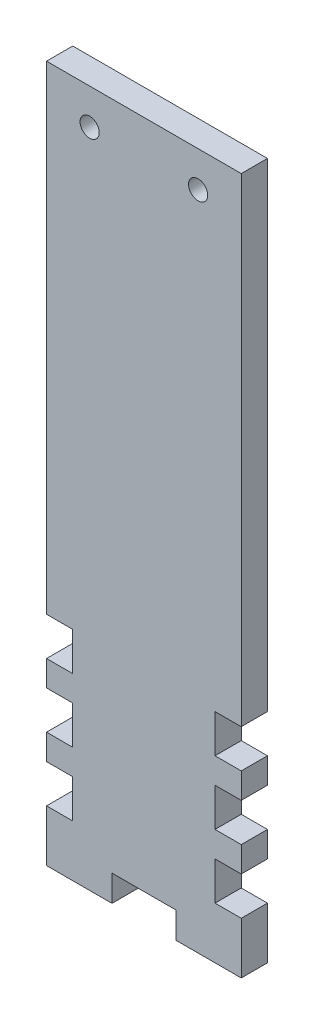
ISO-10303-21;
HEADER;
FILE_DESCRIPTION(('STEP AP214'),'2;1');
FILE_NAME('part.step','',(''),(''),'','','');
FILE_SCHEMA(('AUTOMOTIVE_DESIGN { 1 0 10303 214 1 1 1 1 }'));
ENDSEC;
DATA;
#1=APPLICATION_CONTEXT('core data for automotive mechanical design processes');
#2=APPLICATION_PROTOCOL_DEFINITION('international standard','automotive_design',2000,#1);
#3=PRODUCT_CONTEXT('',#1,'mechanical');
#4=PRODUCT('Part','Part','',(#3));
#5=PRODUCT_RELATED_PRODUCT_CATEGORY('part','',(#4));
#6=PRODUCT_DEFINITION_FORMATION('','',#4);
#7=PRODUCT_DEFINITION_CONTEXT('part definition',#1,'design');
#8=PRODUCT_DEFINITION('design','',#6,#7);
#9=PRODUCT_DEFINITION_SHAPE('','',#8);
#10=(LENGTH_UNIT() NAMED_UNIT(*) SI_UNIT(.MILLI.,.METRE.));
#11=(NAMED_UNIT(*) PLANE_ANGLE_UNIT() SI_UNIT($,.RADIAN.));
#12=(NAMED_UNIT(*) SI_UNIT($,.STERADIAN.) SOLID_ANGLE_UNIT());
#13=UNCERTAINTY_MEASURE_WITH_UNIT(LENGTH_MEASURE(1.E-05),#10,'distance_accuracy_value','');
#14=(GEOMETRIC_REPRESENTATION_CONTEXT(3) GLOBAL_UNCERTAINTY_ASSIGNED_CONTEXT((#13)) GLOBAL_UNIT_ASSIGNED_CONTEXT((#10,
#11,#12)) REPRESENTATION_CONTEXT('',''));
#15=CARTESIAN_POINT('',(0.,0.,0.));
#16=DIRECTION('',(0.,0.,1.));
#17=DIRECTION('',(1.,0.,0.));
#18=AXIS2_PLACEMENT_3D('',#15,#16,#17);
#19=CARTESIAN_POINT('',(-15.26,-123.833512511459,0.889999999999995));
#20=DIRECTION('',(0.,-1.,0.));
#21=DIRECTION('',(0.,0.,-1.));
#22=AXIS2_PLACEMENT_3D('',#19,#20,#21);
#23=PLANE('',#22);
#24=DIRECTION('',(0.,0.,1.));
#25=VECTOR('',#24,1.);
#26=CARTESIAN_POINT('',(4.99999999999999,-123.833512511459,5.));
#27=LINE('',#26,#25);
#28=CARTESIAN_POINT('',(4.99999999999999,-123.833512511459,0.889999999999995));
#29=VERTEX_POINT('',#28);
#30=CARTESIAN_POINT('',(4.99999999999999,-123.833512511459,5.));
#31=VERTEX_POINT('',#30);
#32=EDGE_CURVE('E249',#29,#31,#27,.T.);
#33=ORIENTED_EDGE('',*,*,#32,.F.);
#34=DIRECTION('',(1.,0.,0.));
#35=VECTOR('',#34,1.);
#36=CARTESIAN_POINT('',(-15.26,-123.833512511459,0.889999999999995));
#37=LINE('',#36,#35);
#38=CARTESIAN_POINT('',(15.26,-123.833512511459,0.889999999999995));
#39=VERTEX_POINT('',#38);
#40=EDGE_CURVE('E451',#29,#39,#37,.T.);
#41=ORIENTED_EDGE('',*,*,#40,.T.);
#42=DIRECTION('',(0.,0.,1.));
#43=VECTOR('',#42,1.);
#44=CARTESIAN_POINT('',(15.26,-123.833512511459,0.889999999999995));
#45=LINE('',#44,#43);
#46=CARTESIAN_POINT('',(15.26,-123.833512511459,5.));
#47=VERTEX_POINT('',#46);
#48=EDGE_CURVE('E483',#39,#47,#45,.T.);
#49=ORIENTED_EDGE('',*,*,#48,.T.);
#50=DIRECTION('',(1.,0.,0.));
#51=VECTOR('',#50,1.);
#52=CARTESIAN_POINT('',(-15.26,-123.833512511459,5.));
#53=LINE('',#52,#51);
#54=EDGE_CURVE('E469',#31,#47,#53,.T.);
#55=ORIENTED_EDGE('',*,*,#54,.F.);
#56=EDGE_LOOP('',(#33,#41,#49,#55));
#57=FACE_BOUND('',#56,.T.);
#58=ADVANCED_FACE('F33',(#57),#23,.T.);
#59=CARTESIAN_POINT('',(-15.26,-14.642135623731,0.889999999999995));
#60=DIRECTION('',(-1.,0.,0.));
#61=DIRECTION('',(0.,-1.,0.));
#62=AXIS2_PLACEMENT_3D('',#59,#60,#61);
#63=PLANE('',#62);
#64=DIRECTION('',(0.,-1.,0.));
#65=VECTOR('',#64,1.);
#66=CARTESIAN_POINT('',(-15.26,-14.642135623731,0.889999999999995));
#67=LINE('',#66,#65);
#68=CARTESIAN_POINT('',(-15.26,-95.7235125114591,0.889999999999995));
#69=VERTEX_POINT('',#68);
#70=CARTESIAN_POINT('',(-15.26,-99.7235125114591,0.889999999999995));
#71=VERTEX_POINT('',#70);
#72=EDGE_CURVE('E452',#69,#71,#67,.T.);
#73=ORIENTED_EDGE('',*,*,#72,.T.);
#74=DIRECTION('',(0.,0.,-1.));
#75=VECTOR('',#74,1.);
#76=CARTESIAN_POINT('',(-15.26,-99.7235125114591,5.001));
#77=LINE('',#76,#75);
#78=CARTESIAN_POINT('',(-15.26,-99.7235125114591,5.));
#79=VERTEX_POINT('',#78);
#80=EDGE_CURVE('E299',#79,#71,#77,.T.);
#81=ORIENTED_EDGE('',*,*,#80,.F.);
#82=DIRECTION('',(0.,-1.,0.));
#83=VECTOR('',#82,1.);
#84=CARTESIAN_POINT('',(-15.26,-14.642135623731,5.));
#85=LINE('',#84,#83);
#86=CARTESIAN_POINT('',(-15.26,-95.7235125114591,5.));
#87=VERTEX_POINT('',#86);
#88=EDGE_CURVE('E470',#87,#79,#85,.T.);
#89=ORIENTED_EDGE('',*,*,#88,.F.);
#90=DIRECTION('',(0.,0.,-1.));
#91=VECTOR('',#90,1.);
#92=CARTESIAN_POINT('',(-15.26,-95.7235125114591,5.001));
#93=LINE('',#92,#91);
#94=EDGE_CURVE('E323',#87,#69,#93,.T.);
#95=ORIENTED_EDGE('',*,*,#94,.T.);
#96=EDGE_LOOP('',(#73,#81,#89,#95));
#97=FACE_BOUND('',#96,.T.);
#98=ADVANCED_FACE('F35',(#97),#63,.T.);
#99=CARTESIAN_POINT('',(-15.26,-105.723512511459,5.));
#100=VERTEX_POINT('',#99);
#101=CARTESIAN_POINT('',(-15.26,-109.723512511459,5.));
#102=VERTEX_POINT('',#101);
#103=EDGE_CURVE('E471',#100,#102,#85,.T.);
#104=ORIENTED_EDGE('',*,*,#103,.F.);
#105=DIRECTION('',(0.,0.,-1.));
#106=VECTOR('',#105,1.);
#107=CARTESIAN_POINT('',(-15.26,-105.723512511459,5.001));
#108=LINE('',#107,#106);
#109=CARTESIAN_POINT('',(-15.26,-105.723512511459,0.889999999999995));
#110=VERTEX_POINT('',#109);
#111=EDGE_CURVE('E58',#100,#110,#108,.T.);
#112=ORIENTED_EDGE('',*,*,#111,.T.);
#113=CARTESIAN_POINT('',(-15.26,-109.723512511459,0.889999999999995));
#114=VERTEX_POINT('',#113);
#115=EDGE_CURVE('E453',#110,#114,#67,.T.);
#116=ORIENTED_EDGE('',*,*,#115,.T.);
#117=DIRECTION('',(0.,0.,-1.));
#118=VECTOR('',#117,1.);
#119=CARTESIAN_POINT('',(-15.26,-109.723512511459,5.001));
#120=LINE('',#119,#118);
#121=EDGE_CURVE('E427',#102,#114,#120,.T.);
#122=ORIENTED_EDGE('',*,*,#121,.F.);
#123=EDGE_LOOP('',(#104,#112,#116,#122));
#124=FACE_BOUND('',#123,.T.);
#125=ADVANCED_FACE('F525',(#124),#63,.T.);
#126=CARTESIAN_POINT('',(-15.26,-14.642135623731,0.889999999999995));
#127=VERTEX_POINT('',#126);
#128=CARTESIAN_POINT('',(-15.26,-89.7235125114591,0.889999999999995));
#129=VERTEX_POINT('',#128);
#130=EDGE_CURVE('E448',#127,#129,#67,.T.);
#131=ORIENTED_EDGE('',*,*,#130,.T.);
#132=DIRECTION('',(0.,0.,-1.));
#133=VECTOR('',#132,1.);
#134=CARTESIAN_POINT('',(-15.26,-89.7235125114591,5.001));
#135=LINE('',#134,#133);
#136=CARTESIAN_POINT('',(-15.26,-89.7235125114591,5.));
#137=VERTEX_POINT('',#136);
#138=EDGE_CURVE('E326',#137,#129,#135,.T.);
#139=ORIENTED_EDGE('',*,*,#138,.F.);
#140=CARTESIAN_POINT('',(-15.26,-14.642135623731,5.));
#141=VERTEX_POINT('',#140);
#142=EDGE_CURVE('E466',#141,#137,#85,.T.);
#143=ORIENTED_EDGE('',*,*,#142,.F.);
#144=DIRECTION('',(0.,0.,1.));
#145=VECTOR('',#144,1.);
#146=CARTESIAN_POINT('',(-15.26,-14.642135623731,0.889999999999995));
#147=LINE('',#146,#145);
#148=EDGE_CURVE('E11',#127,#141,#147,.T.);
#149=ORIENTED_EDGE('',*,*,#148,.F.);
#150=EDGE_LOOP('',(#131,#139,#143,#149));
#151=FACE_BOUND('',#150,.T.);
#152=ADVANCED_FACE('F565',(#151),#63,.T.);
#153=CARTESIAN_POINT('',(0.,0.,0.889999999999995));
#154=DIRECTION('',(0.,0.,1.));
#155=DIRECTION('',(1.,0.,0.));
#156=AXIS2_PLACEMENT_3D('',#153,#154,#155);
#157=PLANE('',#156);
#158=ORIENTED_EDGE('',*,*,#40,.F.);
#159=DIRECTION('',(0.,-1.,0.));
#160=VECTOR('',#159,1.);
#161=CARTESIAN_POINT('',(4.99999999999999,-119.723512511459,0.889999999999995));
#162=LINE('',#161,#160);
#163=CARTESIAN_POINT('',(4.99999999999999,-119.723512511459,0.889999999999995));
#164=VERTEX_POINT('',#163);
#165=EDGE_CURVE('E274',#164,#29,#162,.T.);
#166=ORIENTED_EDGE('',*,*,#165,.F.);
#167=DIRECTION('',(1.,0.,0.));
#168=VECTOR('',#167,1.);
#169=CARTESIAN_POINT('',(4.99999999999999,-119.723512511459,0.889999999999995));
#170=LINE('',#169,#168);
#171=CARTESIAN_POINT('',(-5.00000000000001,-119.723512511459,0.889999999999995));
#172=VERTEX_POINT('',#171);
#173=EDGE_CURVE('E253',#172,#164,#170,.T.);
#174=ORIENTED_EDGE('',*,*,#173,.F.);
#175=DIRECTION('',(0.,-1.,0.));
#176=VECTOR('',#175,1.);
#177=CARTESIAN_POINT('',(-5.00000000000001,-119.723512511459,0.889999999999995));
#178=LINE('',#177,#176);
#179=CARTESIAN_POINT('',(-5.00000000000002,-123.833512511459,0.889999999999995));
#180=VERTEX_POINT('',#179);
#181=EDGE_CURVE('E277',#172,#180,#178,.T.);
#182=ORIENTED_EDGE('',*,*,#181,.T.);
#183=CARTESIAN_POINT('',(-15.26,-123.833512511459,0.889999999999995));
#184=VERTEX_POINT('',#183);
#185=EDGE_CURVE('E455',#184,#180,#37,.T.);
#186=ORIENTED_EDGE('',*,*,#185,.F.);
#187=CARTESIAN_POINT('',(-15.26,-115.723512511459,0.889999999999995));
#188=VERTEX_POINT('',#187);
#189=EDGE_CURVE('E454',#188,#184,#67,.T.);
#190=ORIENTED_EDGE('',*,*,#189,.F.);
#191=DIRECTION('',(1.,0.,0.));
#192=VECTOR('',#191,1.);
#193=CARTESIAN_POINT('',(0.,-115.723512511459,0.889999999999995));
#194=LINE('',#193,#192);
#195=CARTESIAN_POINT('',(-11.15,-115.723512511459,0.889999999999995));
#196=VERTEX_POINT('',#195);
#197=EDGE_CURVE('E419',#188,#196,#194,.T.);
#198=ORIENTED_EDGE('',*,*,#197,.T.);
#199=DIRECTION('',(0.,1.,0.));
#200=VECTOR('',#199,1.);
#201=CARTESIAN_POINT('',(-11.1500000000001,0.,0.889999999999995));
#202=LINE('',#201,#200);
#203=CARTESIAN_POINT('',(-11.15,-109.723512511459,0.889999999999995));
#204=VERTEX_POINT('',#203);
#205=EDGE_CURVE('E413',#196,#204,#202,.T.);
#206=ORIENTED_EDGE('',*,*,#205,.T.);
#207=DIRECTION('',(-1.,0.,0.));
#208=VECTOR('',#207,1.);
#209=CARTESIAN_POINT('',(0.,-109.723512511459,0.889999999999995));
#210=LINE('',#209,#208);
#211=EDGE_CURVE('E416',#204,#114,#210,.T.);
#212=ORIENTED_EDGE('',*,*,#211,.T.);
#213=ORIENTED_EDGE('',*,*,#115,.F.);
#214=DIRECTION('',(1.,0.,0.));
#215=VECTOR('',#214,1.);
#216=CARTESIAN_POINT('',(0.,-105.723512511459,0.889999999999995));
#217=LINE('',#216,#215);
#218=CARTESIAN_POINT('',(-11.15,-105.723512511459,0.889999999999995));
#219=VERTEX_POINT('',#218);
#220=EDGE_CURVE('E293',#110,#219,#217,.T.);
#221=ORIENTED_EDGE('',*,*,#220,.T.);
#222=DIRECTION('',(0.,1.,0.));
#223=VECTOR('',#222,1.);
#224=CARTESIAN_POINT('',(-11.1500000000001,0.,0.889999999999995));
#225=LINE('',#224,#223);
#226=CARTESIAN_POINT('',(-11.15,-99.7235125114591,0.889999999999995));
#227=VERTEX_POINT('',#226);
#228=EDGE_CURVE('E287',#219,#227,#225,.T.);
#229=ORIENTED_EDGE('',*,*,#228,.T.);
#230=DIRECTION('',(-1.,0.,0.));
#231=VECTOR('',#230,1.);
#232=CARTESIAN_POINT('',(0.,-99.7235125114591,0.889999999999995));
#233=LINE('',#232,#231);
#234=EDGE_CURVE('E290',#227,#71,#233,.T.);
#235=ORIENTED_EDGE('',*,*,#234,.T.);
#236=ORIENTED_EDGE('',*,*,#72,.F.);
#237=DIRECTION('',(1.,0.,0.));
#238=VECTOR('',#237,1.);
#239=CARTESIAN_POINT('',(0.,-95.7235125114591,0.889999999999995));
#240=LINE('',#239,#238);
#241=CARTESIAN_POINT('',(-11.15,-95.7235125114591,0.889999999999995));
#242=VERTEX_POINT('',#241);
#243=EDGE_CURVE('E318',#69,#242,#240,.T.);
#244=ORIENTED_EDGE('',*,*,#243,.T.);
#245=DIRECTION('',(0.,1.,0.));
#246=VECTOR('',#245,1.);
#247=CARTESIAN_POINT('',(-11.1500000000001,0.,0.889999999999995));
#248=LINE('',#247,#246);
#249=CARTESIAN_POINT('',(-11.15,-89.7235125114591,0.889999999999995));
#250=VERTEX_POINT('',#249);
#251=EDGE_CURVE('E312',#242,#250,#248,.T.);
#252=ORIENTED_EDGE('',*,*,#251,.T.);
#253=DIRECTION('',(-1.,0.,0.));
#254=VECTOR('',#253,1.);
#255=CARTESIAN_POINT('',(0.,-89.7235125114591,0.889999999999995));
#256=LINE('',#255,#254);
#257=EDGE_CURVE('E315',#250,#129,#256,.T.);
#258=ORIENTED_EDGE('',*,*,#257,.T.);
#259=ORIENTED_EDGE('',*,*,#130,.F.);
#260=DIRECTION('',(-1.,0.,0.));
#261=VECTOR('',#260,1.);
#262=CARTESIAN_POINT('',(-15.26,-14.642135623731,0.889999999999995));
#263=LINE('',#262,#261);
#264=CARTESIAN_POINT('',(15.26,-14.642135623731,0.889999999999995));
#265=VERTEX_POINT('',#264);
#266=EDGE_CURVE('E462',#265,#127,#263,.T.);
#267=ORIENTED_EDGE('',*,*,#266,.F.);
#268=DIRECTION('',(0.,1.,0.));
#269=VECTOR('',#268,1.);
#270=CARTESIAN_POINT('',(15.26,-14.642135623731,0.889999999999995));
#271=LINE('',#270,#269);
#272=CARTESIAN_POINT('',(15.26,-89.7235125114591,0.889999999999995));
#273=VERTEX_POINT('',#272);
#274=EDGE_CURVE('E458',#273,#265,#271,.T.);
#275=ORIENTED_EDGE('',*,*,#274,.F.);
#276=DIRECTION('',(-1.,0.,0.));
#277=VECTOR('',#276,1.);
#278=CARTESIAN_POINT('',(0.,-89.7235125114591,0.889999999999995));
#279=LINE('',#278,#277);
#280=CARTESIAN_POINT('',(11.15,-89.7235125114591,0.889999999999995));
#281=VERTEX_POINT('',#280);
#282=EDGE_CURVE('E394',#273,#281,#279,.T.);
#283=ORIENTED_EDGE('',*,*,#282,.T.);
#284=DIRECTION('',(0.,-1.,0.));
#285=VECTOR('',#284,1.);
#286=CARTESIAN_POINT('',(11.15,0.,0.889999999999995));
#287=LINE('',#286,#285);
#288=CARTESIAN_POINT('',(11.15,-95.7235125114591,0.889999999999995));
#289=VERTEX_POINT('',#288);
#290=EDGE_CURVE('E388',#281,#289,#287,.T.);
#291=ORIENTED_EDGE('',*,*,#290,.T.);
#292=DIRECTION('',(1.,0.,0.));
#293=VECTOR('',#292,1.);
#294=CARTESIAN_POINT('',(0.,-95.7235125114591,0.889999999999995));
#295=LINE('',#294,#293);
#296=CARTESIAN_POINT('',(15.26,-95.7235125114591,0.889999999999995));
#297=VERTEX_POINT('',#296);
#298=EDGE_CURVE('E391',#289,#297,#295,.T.);
#299=ORIENTED_EDGE('',*,*,#298,.T.);
#300=CARTESIAN_POINT('',(15.26,-99.7235125114591,0.889999999999995));
#301=VERTEX_POINT('',#300);
#302=EDGE_CURVE('E613',#301,#297,#271,.T.);
#303=ORIENTED_EDGE('',*,*,#302,.F.);
#304=DIRECTION('',(-1.,0.,0.));
#305=VECTOR('',#304,1.);
#306=CARTESIAN_POINT('',(0.,-99.7235125114591,0.889999999999995));
#307=LINE('',#306,#305);
#308=CARTESIAN_POINT('',(11.15,-99.7235125114591,0.889999999999995));
#309=VERTEX_POINT('',#308);
#310=EDGE_CURVE('E370',#301,#309,#307,.T.);
#311=ORIENTED_EDGE('',*,*,#310,.T.);
#312=DIRECTION('',(0.,-1.,0.));
#313=VECTOR('',#312,1.);
#314=CARTESIAN_POINT('',(11.1500000000001,0.,0.889999999999995));
#315=LINE('',#314,#313);
#316=CARTESIAN_POINT('',(11.15,-105.723512511459,0.889999999999995));
#317=VERTEX_POINT('',#316);
#318=EDGE_CURVE('E364',#309,#317,#315,.T.);
#319=ORIENTED_EDGE('',*,*,#318,.T.);
#320=DIRECTION('',(1.,0.,0.));
#321=VECTOR('',#320,1.);
#322=CARTESIAN_POINT('',(0.,-105.723512511459,0.889999999999995));
#323=LINE('',#322,#321);
#324=CARTESIAN_POINT('',(15.26,-105.723512511459,0.889999999999995));
#325=VERTEX_POINT('',#324);
#326=EDGE_CURVE('E367',#317,#325,#323,.T.);
#327=ORIENTED_EDGE('',*,*,#326,.T.);
#328=CARTESIAN_POINT('',(15.26,-109.723512511459,0.889999999999995));
#329=VERTEX_POINT('',#328);
#330=EDGE_CURVE('E463',#329,#325,#271,.T.);
#331=ORIENTED_EDGE('',*,*,#330,.F.);
#332=DIRECTION('',(-1.,0.,0.));
#333=VECTOR('',#332,1.);
#334=CARTESIAN_POINT('',(0.,-109.723512511459,0.889999999999995));
#335=LINE('',#334,#333);
#336=CARTESIAN_POINT('',(11.15,-109.723512511459,0.889999999999995));
#337=VERTEX_POINT('',#336);
#338=EDGE_CURVE('E344',#329,#337,#335,.T.);
#339=ORIENTED_EDGE('',*,*,#338,.T.);
#340=DIRECTION('',(0.,-1.,0.));
#341=VECTOR('',#340,1.);
#342=CARTESIAN_POINT('',(11.1500000000001,0.,0.889999999999995));
#343=LINE('',#342,#341);
#344=CARTESIAN_POINT('',(11.15,-115.723512511459,0.889999999999995));
#345=VERTEX_POINT('',#344);
#346=EDGE_CURVE('E338',#337,#345,#343,.T.);
#347=ORIENTED_EDGE('',*,*,#346,.T.);
#348=DIRECTION('',(1.,0.,0.));
#349=VECTOR('',#348,1.);
#350=CARTESIAN_POINT('',(0.,-115.723512511459,0.889999999999995));
#351=LINE('',#350,#349);
#352=CARTESIAN_POINT('',(15.26,-115.723512511459,0.889999999999995));
#353=VERTEX_POINT('',#352);
#354=EDGE_CURVE('E341',#345,#353,#351,.T.);
#355=ORIENTED_EDGE('',*,*,#354,.T.);
#356=EDGE_CURVE('E459',#39,#353,#271,.T.);
#357=ORIENTED_EDGE('',*,*,#356,.F.);
#358=EDGE_LOOP('',(#158,#166,#174,#182,#186,#190,#198,#206,#212,#213,#221,#229,#235,#236,#244,
#252,#258,#259,#267,#275,#283,#291,#299,#303,#311,#319,#327,#331,#339,#347,#355,#357));
#359=FACE_BOUND('',#358,.T.);
#360=CARTESIAN_POINT('',(-8.5,-20.23,0.889999999999995));
#361=DIRECTION('',(0.,0.,1.));
#362=DIRECTION('',(1.,0.,0.));
#363=AXIS2_PLACEMENT_3D('',#360,#361,#362);
#364=CIRCLE('',#363,1.5);
#365=CARTESIAN_POINT('',(-7.,-20.23,0.889999999999995));
#366=VERTEX_POINT('',#365);
#367=EDGE_CURVE('E436',#366,#366,#364,.T.);
#368=ORIENTED_EDGE('',*,*,#367,.T.);
#369=EDGE_LOOP('',(#368));
#370=FACE_BOUND('',#369,.T.);
#371=CARTESIAN_POINT('',(8.5,-20.23,0.889999999999995));
#372=DIRECTION('',(0.,0.,1.));
#373=DIRECTION('',(1.,0.,0.));
#374=AXIS2_PLACEMENT_3D('',#371,#372,#373);
#375=CIRCLE('',#374,1.5);
#376=CARTESIAN_POINT('',(10.,-20.23,0.889999999999995));
#377=VERTEX_POINT('',#376);
#378=EDGE_CURVE('E442',#377,#377,#375,.T.);
#379=ORIENTED_EDGE('',*,*,#378,.T.);
#380=EDGE_LOOP('',(#379));
#381=FACE_BOUND('',#380,.T.);
#382=ADVANCED_FACE('F515',(#359,#370,#381),#157,.F.);
#383=CARTESIAN_POINT('',(0.,0.,5.));
#384=DIRECTION('',(0.,0.,1.));
#385=DIRECTION('',(1.,0.,0.));
#386=AXIS2_PLACEMENT_3D('',#383,#384,#385);
#387=PLANE('',#386);
#388=DIRECTION('',(0.,-1.,0.));
#389=VECTOR('',#388,1.);
#390=CARTESIAN_POINT('',(4.99999999999999,-119.723512511459,5.));
#391=LINE('',#390,#389);
#392=CARTESIAN_POINT('',(4.99999999999999,-119.723512511459,5.));
#393=VERTEX_POINT('',#392);
#394=EDGE_CURVE('E243',#393,#31,#391,.T.);
#395=ORIENTED_EDGE('',*,*,#394,.T.);
#396=ORIENTED_EDGE('',*,*,#54,.T.);
#397=DIRECTION('',(0.,1.,0.));
#398=VECTOR('',#397,1.);
#399=CARTESIAN_POINT('',(15.26,-14.642135623731,5.));
#400=LINE('',#399,#398);
#401=CARTESIAN_POINT('',(15.26,-115.723512511459,5.));
#402=VERTEX_POINT('',#401);
#403=EDGE_CURVE('E475',#47,#402,#400,.T.);
#404=ORIENTED_EDGE('',*,*,#403,.T.);
#405=DIRECTION('',(1.,0.,0.));
#406=VECTOR('',#405,1.);
#407=CARTESIAN_POINT('',(0.,-115.723512511459,5.));
#408=LINE('',#407,#406);
#409=CARTESIAN_POINT('',(11.15,-115.723512511459,5.));
#410=VERTEX_POINT('',#409);
#411=EDGE_CURVE('E335',#410,#402,#408,.T.);
#412=ORIENTED_EDGE('',*,*,#411,.F.);
#413=DIRECTION('',(0.,-1.,0.));
#414=VECTOR('',#413,1.);
#415=CARTESIAN_POINT('',(11.1500000000001,0.,5.));
#416=LINE('',#415,#414);
#417=CARTESIAN_POINT('',(11.15,-109.723512511459,5.));
#418=VERTEX_POINT('',#417);
#419=EDGE_CURVE('E332',#418,#410,#416,.T.);
#420=ORIENTED_EDGE('',*,*,#419,.F.);
#421=DIRECTION('',(-1.,0.,0.));
#422=VECTOR('',#421,1.);
#423=CARTESIAN_POINT('',(0.,-109.723512511459,5.));
#424=LINE('',#423,#422);
#425=CARTESIAN_POINT('',(15.26,-109.723512511459,5.));
#426=VERTEX_POINT('',#425);
#427=EDGE_CURVE('E310',#426,#418,#424,.T.);
#428=ORIENTED_EDGE('',*,*,#427,.F.);
#429=CARTESIAN_POINT('',(15.26,-105.723512511459,5.));
#430=VERTEX_POINT('',#429);
#431=EDGE_CURVE('E479',#426,#430,#400,.T.);
#432=ORIENTED_EDGE('',*,*,#431,.T.);
#433=DIRECTION('',(1.,0.,0.));
#434=VECTOR('',#433,1.);
#435=CARTESIAN_POINT('',(0.,-105.723512511459,5.));
#436=LINE('',#435,#434);
#437=CARTESIAN_POINT('',(11.15,-105.723512511459,5.));
#438=VERTEX_POINT('',#437);
#439=EDGE_CURVE('E361',#438,#430,#436,.T.);
#440=ORIENTED_EDGE('',*,*,#439,.F.);
#441=DIRECTION('',(0.,-1.,0.));
#442=VECTOR('',#441,1.);
#443=CARTESIAN_POINT('',(11.1500000000001,0.,5.));
#444=LINE('',#443,#442);
#445=CARTESIAN_POINT('',(11.15,-99.7235125114591,5.));
#446=VERTEX_POINT('',#445);
#447=EDGE_CURVE('E358',#446,#438,#444,.T.);
#448=ORIENTED_EDGE('',*,*,#447,.F.);
#449=DIRECTION('',(-1.,0.,0.));
#450=VECTOR('',#449,1.);
#451=CARTESIAN_POINT('',(0.,-99.7235125114591,5.));
#452=LINE('',#451,#450);
#453=CARTESIAN_POINT('',(15.26,-99.7235125114591,5.));
#454=VERTEX_POINT('',#453);
#455=EDGE_CURVE('E336',#454,#446,#452,.T.);
#456=ORIENTED_EDGE('',*,*,#455,.F.);
#457=CARTESIAN_POINT('',(15.26,-95.7235125114591,5.));
#458=VERTEX_POINT('',#457);
#459=EDGE_CURVE('E589',#454,#458,#400,.T.);
#460=ORIENTED_EDGE('',*,*,#459,.T.);
#461=DIRECTION('',(1.,0.,0.));
#462=VECTOR('',#461,1.);
#463=CARTESIAN_POINT('',(0.,-95.7235125114591,5.));
#464=LINE('',#463,#462);
#465=CARTESIAN_POINT('',(11.15,-95.7235125114591,5.));
#466=VERTEX_POINT('',#465);
#467=EDGE_CURVE('E386',#466,#458,#464,.T.);
#468=ORIENTED_EDGE('',*,*,#467,.F.);
#469=DIRECTION('',(0.,-1.,0.));
#470=VECTOR('',#469,1.);
#471=CARTESIAN_POINT('',(11.15,0.,5.));
#472=LINE('',#471,#470);
#473=CARTESIAN_POINT('',(11.15,-89.7235125114591,5.));
#474=VERTEX_POINT('',#473);
#475=EDGE_CURVE('E276',#474,#466,#472,.T.);
#476=ORIENTED_EDGE('',*,*,#475,.F.);
#477=DIRECTION('',(-1.,0.,0.));
#478=VECTOR('',#477,1.);
#479=CARTESIAN_POINT('',(0.,-89.7235125114591,5.));
#480=LINE('',#479,#478);
#481=CARTESIAN_POINT('',(15.26,-89.7235125114591,5.));
#482=VERTEX_POINT('',#481);
#483=EDGE_CURVE('E362',#482,#474,#480,.T.);
#484=ORIENTED_EDGE('',*,*,#483,.F.);
#485=CARTESIAN_POINT('',(15.26,-14.642135623731,5.));
#486=VERTEX_POINT('',#485);
#487=EDGE_CURVE('E474',#482,#486,#400,.T.);
#488=ORIENTED_EDGE('',*,*,#487,.T.);
#489=DIRECTION('',(-1.,0.,0.));
#490=VECTOR('',#489,1.);
#491=CARTESIAN_POINT('',(-15.26,-14.642135623731,5.));
#492=LINE('',#491,#490);
#493=EDGE_CURVE('E478',#486,#141,#492,.T.);
#494=ORIENTED_EDGE('',*,*,#493,.T.);
#495=ORIENTED_EDGE('',*,*,#142,.T.);
#496=DIRECTION('',(-1.,0.,0.));
#497=VECTOR('',#496,1.);
#498=CARTESIAN_POINT('',(0.,-89.7235125114591,5.));
#499=LINE('',#498,#497);
#500=CARTESIAN_POINT('',(-11.15,-89.7235125114591,5.));
#501=VERTEX_POINT('',#500);
#502=EDGE_CURVE('E309',#501,#137,#499,.T.);
#503=ORIENTED_EDGE('',*,*,#502,.F.);
#504=DIRECTION('',(0.,1.,0.));
#505=VECTOR('',#504,1.);
#506=CARTESIAN_POINT('',(-11.1500000000001,0.,5.));
#507=LINE('',#506,#505);
#508=CARTESIAN_POINT('',(-11.15,-95.7235125114591,5.));
#509=VERTEX_POINT('',#508);
#510=EDGE_CURVE('E306',#509,#501,#507,.T.);
#511=ORIENTED_EDGE('',*,*,#510,.F.);
#512=DIRECTION('',(1.,0.,0.));
#513=VECTOR('',#512,1.);
#514=CARTESIAN_POINT('',(0.,-95.7235125114591,5.));
#515=LINE('',#514,#513);
#516=EDGE_CURVE('E285',#87,#509,#515,.T.);
#517=ORIENTED_EDGE('',*,*,#516,.F.);
#518=ORIENTED_EDGE('',*,*,#88,.T.);
#519=DIRECTION('',(-1.,0.,0.));
#520=VECTOR('',#519,1.);
#521=CARTESIAN_POINT('',(0.,-99.7235125114591,5.));
#522=LINE('',#521,#520);
#523=CARTESIAN_POINT('',(-11.15,-99.7235125114591,5.));
#524=VERTEX_POINT('',#523);
#525=EDGE_CURVE('E284',#524,#79,#522,.T.);
#526=ORIENTED_EDGE('',*,*,#525,.F.);
#527=DIRECTION('',(0.,1.,0.));
#528=VECTOR('',#527,1.);
#529=CARTESIAN_POINT('',(-11.1500000000001,0.,5.));
#530=LINE('',#529,#528);
#531=CARTESIAN_POINT('',(-11.15,-105.723512511459,5.));
#532=VERTEX_POINT('',#531);
#533=EDGE_CURVE('E281',#532,#524,#530,.T.);
#534=ORIENTED_EDGE('',*,*,#533,.F.);
#535=DIRECTION('',(1.,0.,0.));
#536=VECTOR('',#535,1.);
#537=CARTESIAN_POINT('',(0.,-105.723512511459,5.));
#538=LINE('',#537,#536);
#539=EDGE_CURVE('E303',#100,#532,#538,.T.);
#540=ORIENTED_EDGE('',*,*,#539,.F.);
#541=ORIENTED_EDGE('',*,*,#103,.T.);
#542=DIRECTION('',(-1.,0.,0.));
#543=VECTOR('',#542,1.);
#544=CARTESIAN_POINT('',(0.,-109.723512511459,5.));
#545=LINE('',#544,#543);
#546=CARTESIAN_POINT('',(-11.15,-109.723512511459,5.));
#547=VERTEX_POINT('',#546);
#548=EDGE_CURVE('E410',#547,#102,#545,.T.);
#549=ORIENTED_EDGE('',*,*,#548,.F.);
#550=DIRECTION('',(0.,1.,0.));
#551=VECTOR('',#550,1.);
#552=CARTESIAN_POINT('',(-11.1500000000001,0.,5.));
#553=LINE('',#552,#551);
#554=CARTESIAN_POINT('',(-11.15,-115.723512511459,5.));
#555=VERTEX_POINT('',#554);
#556=EDGE_CURVE('E305',#555,#547,#553,.T.);
#557=ORIENTED_EDGE('',*,*,#556,.F.);
#558=DIRECTION('',(1.,0.,0.));
#559=VECTOR('',#558,1.);
#560=CARTESIAN_POINT('',(0.,-115.723512511459,5.));
#561=LINE('',#560,#559);
#562=CARTESIAN_POINT('',(-15.26,-115.723512511459,5.));
#563=VERTEX_POINT('',#562);
#564=EDGE_CURVE('E432',#563,#555,#561,.T.);
#565=ORIENTED_EDGE('',*,*,#564,.F.);
#566=CARTESIAN_POINT('',(-15.26,-123.833512511459,5.));
#567=VERTEX_POINT('',#566);
#568=EDGE_CURVE('E445',#563,#567,#85,.T.);
#569=ORIENTED_EDGE('',*,*,#568,.T.);
#570=CARTESIAN_POINT('',(-5.00000000000002,-123.833512511459,5.));
#571=VERTEX_POINT('',#570);
#572=EDGE_CURVE('E472',#567,#571,#53,.T.);
#573=ORIENTED_EDGE('',*,*,#572,.T.);
#574=DIRECTION('',(0.,-1.,0.));
#575=VECTOR('',#574,1.);
#576=CARTESIAN_POINT('',(-5.00000000000001,-119.723512511459,5.));
#577=LINE('',#576,#575);
#578=CARTESIAN_POINT('',(-5.00000000000001,-119.723512511459,5.));
#579=VERTEX_POINT('',#578);
#580=EDGE_CURVE('E50',#579,#571,#577,.T.);
#581=ORIENTED_EDGE('',*,*,#580,.F.);
#582=DIRECTION('',(-1.,0.,0.));
#583=VECTOR('',#582,1.);
#584=CARTESIAN_POINT('',(4.99999999999999,-119.723512511459,5.));
#585=LINE('',#584,#583);
#586=EDGE_CURVE('E259',#393,#579,#585,.T.);
#587=ORIENTED_EDGE('',*,*,#586,.F.);
#588=EDGE_LOOP('',(#395,#396,#404,#412,#420,#428,#432,#440,#448,#456,#460,#468,#476,#484,#488,
#494,#495,#503,#511,#517,#518,#526,#534,#540,#541,#549,#557,#565,#569,#573,#581,#587));
#589=FACE_BOUND('',#588,.T.);
#590=CARTESIAN_POINT('',(-8.5,-20.23,5.));
#591=DIRECTION('',(0.,0.,1.));
#592=DIRECTION('',(1.,0.,0.));
#593=AXIS2_PLACEMENT_3D('',#590,#591,#592);
#594=CIRCLE('',#593,1.5);
#595=CARTESIAN_POINT('',(-7.,-20.23,5.));
#596=VERTEX_POINT('',#595);
#597=EDGE_CURVE('E435',#596,#596,#594,.T.);
#598=ORIENTED_EDGE('',*,*,#597,.F.);
#599=EDGE_LOOP('',(#598));
#600=FACE_BOUND('',#599,.T.);
#601=CARTESIAN_POINT('',(8.5,-20.23,5.));
#602=DIRECTION('',(0.,0.,1.));
#603=DIRECTION('',(1.,0.,0.));
#604=AXIS2_PLACEMENT_3D('',#601,#602,#603);
#605=CIRCLE('',#604,1.5);
#606=CARTESIAN_POINT('',(10.,-20.23,5.));
#607=VERTEX_POINT('',#606);
#608=EDGE_CURVE('E439',#607,#607,#605,.T.);
#609=ORIENTED_EDGE('',*,*,#608,.F.);
#610=EDGE_LOOP('',(#609));
#611=FACE_BOUND('',#610,.T.);
#612=ADVANCED_FACE('F264',(#589,#600,#611),#387,.T.);
#613=CARTESIAN_POINT('',(15.26,-14.642135623731,0.889999999999995));
#614=DIRECTION('',(1.,0.,0.));
#615=DIRECTION('',(0.,1.,0.));
#616=AXIS2_PLACEMENT_3D('',#613,#614,#615);
#617=PLANE('',#616);
#618=ORIENTED_EDGE('',*,*,#356,.T.);
#619=DIRECTION('',(0.,0.,-1.));
#620=VECTOR('',#619,1.);
#621=CARTESIAN_POINT('',(15.26,-115.723512511459,5.001));
#622=LINE('',#621,#620);
#623=EDGE_CURVE('E352',#402,#353,#622,.T.);
#624=ORIENTED_EDGE('',*,*,#623,.F.);
#625=ORIENTED_EDGE('',*,*,#403,.F.);
#626=ORIENTED_EDGE('',*,*,#48,.F.);
#627=EDGE_LOOP('',(#618,#624,#625,#626));
#628=FACE_BOUND('',#627,.T.);
#629=ADVANCED_FACE('F569',(#628),#617,.T.);
#630=ORIENTED_EDGE('',*,*,#431,.F.);
#631=DIRECTION('',(0.,0.,-1.));
#632=VECTOR('',#631,1.);
#633=CARTESIAN_POINT('',(15.26,-109.723512511459,5.001));
#634=LINE('',#633,#632);
#635=EDGE_CURVE('E349',#426,#329,#634,.T.);
#636=ORIENTED_EDGE('',*,*,#635,.T.);
#637=ORIENTED_EDGE('',*,*,#330,.T.);
#638=DIRECTION('',(0.,0.,-1.));
#639=VECTOR('',#638,1.);
#640=CARTESIAN_POINT('',(15.26,-105.723512511459,5.001));
#641=LINE('',#640,#639);
#642=EDGE_CURVE('E378',#430,#325,#641,.T.);
#643=ORIENTED_EDGE('',*,*,#642,.F.);
#644=EDGE_LOOP('',(#630,#636,#637,#643));
#645=FACE_BOUND('',#644,.T.);
#646=ADVANCED_FACE('F571',(#645),#617,.T.);
#647=ORIENTED_EDGE('',*,*,#459,.F.);
#648=DIRECTION('',(0.,0.,-1.));
#649=VECTOR('',#648,1.);
#650=CARTESIAN_POINT('',(15.26,-99.7235125114591,5.001));
#651=LINE('',#650,#649);
#652=EDGE_CURVE('E375',#454,#301,#651,.T.);
#653=ORIENTED_EDGE('',*,*,#652,.T.);
#654=ORIENTED_EDGE('',*,*,#302,.T.);
#655=DIRECTION('',(0.,0.,-1.));
#656=VECTOR('',#655,1.);
#657=CARTESIAN_POINT('',(15.26,-95.7235125114591,5.001));
#658=LINE('',#657,#656);
#659=EDGE_CURVE('E402',#458,#297,#658,.T.);
#660=ORIENTED_EDGE('',*,*,#659,.F.);
#661=EDGE_LOOP('',(#647,#653,#654,#660));
#662=FACE_BOUND('',#661,.T.);
#663=ADVANCED_FACE('F577',(#662),#617,.T.);
#664=ORIENTED_EDGE('',*,*,#487,.F.);
#665=DIRECTION('',(0.,0.,-1.));
#666=VECTOR('',#665,1.);
#667=CARTESIAN_POINT('',(15.26,-89.7235125114591,5.001));
#668=LINE('',#667,#666);
#669=EDGE_CURVE('E399',#482,#273,#668,.T.);
#670=ORIENTED_EDGE('',*,*,#669,.T.);
#671=ORIENTED_EDGE('',*,*,#274,.T.);
#672=DIRECTION('',(0.,0.,1.));
#673=VECTOR('',#672,1.);
#674=CARTESIAN_POINT('',(15.26,-14.642135623731,0.889999999999995));
#675=LINE('',#674,#673);
#676=EDGE_CURVE('E42',#265,#486,#675,.T.);
#677=ORIENTED_EDGE('',*,*,#676,.T.);
#678=EDGE_LOOP('',(#664,#670,#671,#677));
#679=FACE_BOUND('',#678,.T.);
#680=ADVANCED_FACE('F564',(#679),#617,.T.);
#681=ORIENTED_EDGE('',*,*,#568,.F.);
#682=DIRECTION('',(0.,0.,-1.));
#683=VECTOR('',#682,1.);
#684=CARTESIAN_POINT('',(-15.26,-115.723512511459,5.001));
#685=LINE('',#684,#683);
#686=EDGE_CURVE('E424',#563,#188,#685,.T.);
#687=ORIENTED_EDGE('',*,*,#686,.T.);
#688=ORIENTED_EDGE('',*,*,#189,.T.);
#689=DIRECTION('',(0.,0.,1.));
#690=VECTOR('',#689,1.);
#691=CARTESIAN_POINT('',(-15.26,-123.833512511459,0.889999999999995));
#692=LINE('',#691,#690);
#693=EDGE_CURVE('E37',#184,#567,#692,.T.);
#694=ORIENTED_EDGE('',*,*,#693,.T.);
#695=EDGE_LOOP('',(#681,#687,#688,#694));
#696=FACE_BOUND('',#695,.T.);
#697=ADVANCED_FACE('F493',(#696),#63,.T.);
#698=CARTESIAN_POINT('',(-15.26,-14.642135623731,0.889999999999995));
#699=DIRECTION('',(0.,1.,0.));
#700=DIRECTION('',(0.,0.,1.));
#701=AXIS2_PLACEMENT_3D('',#698,#699,#700);
#702=PLANE('',#701);
#703=ORIENTED_EDGE('',*,*,#493,.F.);
#704=ORIENTED_EDGE('',*,*,#676,.F.);
#705=ORIENTED_EDGE('',*,*,#266,.T.);
#706=ORIENTED_EDGE('',*,*,#148,.T.);
#707=EDGE_LOOP('',(#703,#704,#705,#706));
#708=FACE_BOUND('',#707,.T.);
#709=ADVANCED_FACE('F551',(#708),#702,.T.);
#710=DIRECTION('',(0.,0.,-1.));
#711=VECTOR('',#710,1.);
#712=CARTESIAN_POINT('',(-5.00000000000002,-123.833512511459,5.));
#713=LINE('',#712,#711);
#714=EDGE_CURVE('E262',#571,#180,#713,.T.);
#715=ORIENTED_EDGE('',*,*,#714,.F.);
#716=ORIENTED_EDGE('',*,*,#572,.F.);
#717=ORIENTED_EDGE('',*,*,#693,.F.);
#718=ORIENTED_EDGE('',*,*,#185,.T.);
#719=EDGE_LOOP('',(#715,#716,#717,#718));
#720=FACE_BOUND('',#719,.T.);
#721=ADVANCED_FACE('F497',(#720),#23,.T.);
#722=CARTESIAN_POINT('',(8.5,-20.23,0.889999999999995));
#723=DIRECTION('',(0.,0.,1.));
#724=DIRECTION('',(1.,0.,0.));
#725=AXIS2_PLACEMENT_3D('',#722,#723,#724);
#726=CYLINDRICAL_SURFACE('',#725,1.5);
#727=ORIENTED_EDGE('',*,*,#378,.F.);
#728=EDGE_LOOP('',(#727));
#729=FACE_BOUND('',#728,.T.);
#730=ORIENTED_EDGE('',*,*,#608,.T.);
#731=EDGE_LOOP('',(#730));
#732=FACE_BOUND('',#731,.T.);
#733=ADVANCED_FACE('F550',(#729,#732),#726,.F.);
#734=CARTESIAN_POINT('',(-8.5,-20.23,0.889999999999995));
#735=DIRECTION('',(0.,0.,1.));
#736=DIRECTION('',(1.,0.,0.));
#737=AXIS2_PLACEMENT_3D('',#734,#735,#736);
#738=CYLINDRICAL_SURFACE('',#737,1.5);
#739=ORIENTED_EDGE('',*,*,#367,.F.);
#740=EDGE_LOOP('',(#739));
#741=FACE_BOUND('',#740,.T.);
#742=ORIENTED_EDGE('',*,*,#597,.T.);
#743=EDGE_LOOP('',(#742));
#744=FACE_BOUND('',#743,.T.);
#745=ADVANCED_FACE('F556',(#741,#744),#738,.F.);
#746=CARTESIAN_POINT('',(-11.1500000000001,0.,5.001));
#747=DIRECTION('',(-1.,0.,0.));
#748=DIRECTION('',(0.,-1.,0.));
#749=AXIS2_PLACEMENT_3D('',#746,#747,#748);
#750=PLANE('',#749);
#751=ORIENTED_EDGE('',*,*,#556,.T.);
#752=DIRECTION('',(0.,0.,-1.));
#753=VECTOR('',#752,1.);
#754=CARTESIAN_POINT('',(-11.15,-109.723512511459,5.001));
#755=LINE('',#754,#753);
#756=EDGE_CURVE('E430',#547,#204,#755,.T.);
#757=ORIENTED_EDGE('',*,*,#756,.T.);
#758=ORIENTED_EDGE('',*,*,#205,.F.);
#759=DIRECTION('',(0.,0.,-1.));
#760=VECTOR('',#759,1.);
#761=CARTESIAN_POINT('',(-11.15,-115.723512511459,5.001));
#762=LINE('',#761,#760);
#763=EDGE_CURVE('E422',#555,#196,#762,.T.);
#764=ORIENTED_EDGE('',*,*,#763,.F.);
#765=EDGE_LOOP('',(#751,#757,#758,#764));
#766=FACE_BOUND('',#765,.T.);
#767=ADVANCED_FACE('F531',(#766),#750,.T.);
#768=CARTESIAN_POINT('',(0.,-109.723512511459,5.001));
#769=DIRECTION('',(0.,-1.,0.));
#770=DIRECTION('',(0.,0.,-1.));
#771=AXIS2_PLACEMENT_3D('',#768,#769,#770);
#772=PLANE('',#771);
#773=ORIENTED_EDGE('',*,*,#548,.T.);
#774=ORIENTED_EDGE('',*,*,#121,.T.);
#775=ORIENTED_EDGE('',*,*,#211,.F.);
#776=ORIENTED_EDGE('',*,*,#756,.F.);
#777=EDGE_LOOP('',(#773,#774,#775,#776));
#778=FACE_BOUND('',#777,.T.);
#779=ADVANCED_FACE('F528',(#778),#772,.T.);
#780=CARTESIAN_POINT('',(0.,-115.723512511459,5.001));
#781=DIRECTION('',(0.,1.,0.));
#782=DIRECTION('',(0.,0.,1.));
#783=AXIS2_PLACEMENT_3D('',#780,#781,#782);
#784=PLANE('',#783);
#785=ORIENTED_EDGE('',*,*,#564,.T.);
#786=ORIENTED_EDGE('',*,*,#763,.T.);
#787=ORIENTED_EDGE('',*,*,#197,.F.);
#788=ORIENTED_EDGE('',*,*,#686,.F.);
#789=EDGE_LOOP('',(#785,#786,#787,#788));
#790=FACE_BOUND('',#789,.T.);
#791=ADVANCED_FACE('F533',(#790),#784,.T.);
#792=CARTESIAN_POINT('',(11.15,0.,5.001));
#793=DIRECTION('',(1.,0.,0.));
#794=DIRECTION('',(0.,0.,-1.));
#795=AXIS2_PLACEMENT_3D('',#792,#793,#794);
#796=PLANE('',#795);
#797=ORIENTED_EDGE('',*,*,#475,.T.);
#798=DIRECTION('',(0.,0.,-1.));
#799=VECTOR('',#798,1.);
#800=CARTESIAN_POINT('',(11.15,-95.7235125114591,5.001));
#801=LINE('',#800,#799);
#802=EDGE_CURVE('E404',#466,#289,#801,.T.);
#803=ORIENTED_EDGE('',*,*,#802,.T.);
#804=ORIENTED_EDGE('',*,*,#290,.F.);
#805=DIRECTION('',(0.,0.,-1.));
#806=VECTOR('',#805,1.);
#807=CARTESIAN_POINT('',(11.15,-89.7235125114591,5.001));
#808=LINE('',#807,#806);
#809=EDGE_CURVE('E397',#474,#281,#808,.T.);
#810=ORIENTED_EDGE('',*,*,#809,.F.);
#811=EDGE_LOOP('',(#797,#803,#804,#810));
#812=FACE_BOUND('',#811,.T.);
#813=ADVANCED_FACE('F619',(#812),#796,.T.);
#814=CARTESIAN_POINT('',(0.,-95.7235125114591,5.001));
#815=DIRECTION('',(0.,1.,0.));
#816=DIRECTION('',(0.,0.,1.));
#817=AXIS2_PLACEMENT_3D('',#814,#815,#816);
#818=PLANE('',#817);
#819=ORIENTED_EDGE('',*,*,#467,.T.);
#820=ORIENTED_EDGE('',*,*,#659,.T.);
#821=ORIENTED_EDGE('',*,*,#298,.F.);
#822=ORIENTED_EDGE('',*,*,#802,.F.);
#823=EDGE_LOOP('',(#819,#820,#821,#822));
#824=FACE_BOUND('',#823,.T.);
#825=ADVANCED_FACE('F616',(#824),#818,.T.);
#826=CARTESIAN_POINT('',(0.,-89.7235125114591,5.001));
#827=DIRECTION('',(0.,-1.,0.));
#828=DIRECTION('',(0.,0.,-1.));
#829=AXIS2_PLACEMENT_3D('',#826,#827,#828);
#830=PLANE('',#829);
#831=ORIENTED_EDGE('',*,*,#483,.T.);
#832=ORIENTED_EDGE('',*,*,#809,.T.);
#833=ORIENTED_EDGE('',*,*,#282,.F.);
#834=ORIENTED_EDGE('',*,*,#669,.F.);
#835=EDGE_LOOP('',(#831,#832,#833,#834));
#836=FACE_BOUND('',#835,.T.);
#837=ADVANCED_FACE('F622',(#836),#830,.T.);
#838=CARTESIAN_POINT('',(11.1500000000001,0.,5.001));
#839=DIRECTION('',(1.,0.,0.));
#840=DIRECTION('',(0.,1.,0.));
#841=AXIS2_PLACEMENT_3D('',#838,#839,#840);
#842=PLANE('',#841);
#843=ORIENTED_EDGE('',*,*,#447,.T.);
#844=DIRECTION('',(0.,0.,-1.));
#845=VECTOR('',#844,1.);
#846=CARTESIAN_POINT('',(11.15,-105.723512511459,5.001));
#847=LINE('',#846,#845);
#848=EDGE_CURVE('E380',#438,#317,#847,.T.);
#849=ORIENTED_EDGE('',*,*,#848,.T.);
#850=ORIENTED_EDGE('',*,*,#318,.F.);
#851=DIRECTION('',(0.,0.,-1.));
#852=VECTOR('',#851,1.);
#853=CARTESIAN_POINT('',(11.15,-99.7235125114591,5.001));
#854=LINE('',#853,#852);
#855=EDGE_CURVE('E373',#446,#309,#854,.T.);
#856=ORIENTED_EDGE('',*,*,#855,.F.);
#857=EDGE_LOOP('',(#843,#849,#850,#856));
#858=FACE_BOUND('',#857,.T.);
#859=ADVANCED_FACE('F609',(#858),#842,.T.);
#860=CARTESIAN_POINT('',(0.,-105.723512511459,5.001));
#861=DIRECTION('',(0.,1.,0.));
#862=DIRECTION('',(0.,0.,1.));
#863=AXIS2_PLACEMENT_3D('',#860,#861,#862);
#864=PLANE('',#863);
#865=ORIENTED_EDGE('',*,*,#439,.T.);
#866=ORIENTED_EDGE('',*,*,#642,.T.);
#867=ORIENTED_EDGE('',*,*,#326,.F.);
#868=ORIENTED_EDGE('',*,*,#848,.F.);
#869=EDGE_LOOP('',(#865,#866,#867,#868));
#870=FACE_BOUND('',#869,.T.);
#871=ADVANCED_FACE('F605',(#870),#864,.T.);
#872=CARTESIAN_POINT('',(0.,-99.7235125114591,5.001));
#873=DIRECTION('',(0.,-1.,0.));
#874=DIRECTION('',(0.,0.,-1.));
#875=AXIS2_PLACEMENT_3D('',#872,#873,#874);
#876=PLANE('',#875);
#877=ORIENTED_EDGE('',*,*,#455,.T.);
#878=ORIENTED_EDGE('',*,*,#855,.T.);
#879=ORIENTED_EDGE('',*,*,#310,.F.);
#880=ORIENTED_EDGE('',*,*,#652,.F.);
#881=EDGE_LOOP('',(#877,#878,#879,#880));
#882=FACE_BOUND('',#881,.T.);
#883=ADVANCED_FACE('F687',(#882),#876,.T.);
#884=CARTESIAN_POINT('',(11.1500000000001,0.,5.001));
#885=DIRECTION('',(1.,0.,0.));
#886=DIRECTION('',(0.,1.,0.));
#887=AXIS2_PLACEMENT_3D('',#884,#885,#886);
#888=PLANE('',#887);
#889=ORIENTED_EDGE('',*,*,#419,.T.);
#890=DIRECTION('',(0.,0.,-1.));
#891=VECTOR('',#890,1.);
#892=CARTESIAN_POINT('',(11.15,-115.723512511459,5.001));
#893=LINE('',#892,#891);
#894=EDGE_CURVE('E354',#410,#345,#893,.T.);
#895=ORIENTED_EDGE('',*,*,#894,.T.);
#896=ORIENTED_EDGE('',*,*,#346,.F.);
#897=DIRECTION('',(0.,0.,-1.));
#898=VECTOR('',#897,1.);
#899=CARTESIAN_POINT('',(11.15,-109.723512511459,5.001));
#900=LINE('',#899,#898);
#901=EDGE_CURVE('E347',#418,#337,#900,.T.);
#902=ORIENTED_EDGE('',*,*,#901,.F.);
#903=EDGE_LOOP('',(#889,#895,#896,#902));
#904=FACE_BOUND('',#903,.T.);
#905=ADVANCED_FACE('F683',(#904),#888,.T.);
#906=CARTESIAN_POINT('',(0.,-115.723512511459,5.001));
#907=DIRECTION('',(0.,1.,0.));
#908=DIRECTION('',(0.,0.,1.));
#909=AXIS2_PLACEMENT_3D('',#906,#907,#908);
#910=PLANE('',#909);
#911=ORIENTED_EDGE('',*,*,#411,.T.);
#912=ORIENTED_EDGE('',*,*,#623,.T.);
#913=ORIENTED_EDGE('',*,*,#354,.F.);
#914=ORIENTED_EDGE('',*,*,#894,.F.);
#915=EDGE_LOOP('',(#911,#912,#913,#914));
#916=FACE_BOUND('',#915,.T.);
#917=ADVANCED_FACE('F679',(#916),#910,.T.);
#918=CARTESIAN_POINT('',(0.,-109.723512511459,5.001));
#919=DIRECTION('',(0.,-1.,0.));
#920=DIRECTION('',(0.,0.,-1.));
#921=AXIS2_PLACEMENT_3D('',#918,#919,#920);
#922=PLANE('',#921);
#923=ORIENTED_EDGE('',*,*,#427,.T.);
#924=ORIENTED_EDGE('',*,*,#901,.T.);
#925=ORIENTED_EDGE('',*,*,#338,.F.);
#926=ORIENTED_EDGE('',*,*,#635,.F.);
#927=EDGE_LOOP('',(#923,#924,#925,#926));
#928=FACE_BOUND('',#927,.T.);
#929=ADVANCED_FACE('F676',(#928),#922,.T.);
#930=CARTESIAN_POINT('',(-11.1500000000001,0.,5.001));
#931=DIRECTION('',(-1.,0.,0.));
#932=DIRECTION('',(0.,-1.,0.));
#933=AXIS2_PLACEMENT_3D('',#930,#931,#932);
#934=PLANE('',#933);
#935=ORIENTED_EDGE('',*,*,#510,.T.);
#936=DIRECTION('',(0.,0.,-1.));
#937=VECTOR('',#936,1.);
#938=CARTESIAN_POINT('',(-11.15,-89.7235125114591,5.001));
#939=LINE('',#938,#937);
#940=EDGE_CURVE('E328',#501,#250,#939,.T.);
#941=ORIENTED_EDGE('',*,*,#940,.T.);
#942=ORIENTED_EDGE('',*,*,#251,.F.);
#943=DIRECTION('',(0.,0.,-1.));
#944=VECTOR('',#943,1.);
#945=CARTESIAN_POINT('',(-11.15,-95.7235125114591,5.001));
#946=LINE('',#945,#944);
#947=EDGE_CURVE('E321',#509,#242,#946,.T.);
#948=ORIENTED_EDGE('',*,*,#947,.F.);
#949=EDGE_LOOP('',(#935,#941,#942,#948));
#950=FACE_BOUND('',#949,.T.);
#951=ADVANCED_FACE('F661',(#950),#934,.T.);
#952=CARTESIAN_POINT('',(0.,-89.7235125114591,5.001));
#953=DIRECTION('',(0.,-1.,0.));
#954=DIRECTION('',(0.,0.,-1.));
#955=AXIS2_PLACEMENT_3D('',#952,#953,#954);
#956=PLANE('',#955);
#957=ORIENTED_EDGE('',*,*,#502,.T.);
#958=ORIENTED_EDGE('',*,*,#138,.T.);
#959=ORIENTED_EDGE('',*,*,#257,.F.);
#960=ORIENTED_EDGE('',*,*,#940,.F.);
#961=EDGE_LOOP('',(#957,#958,#959,#960));
#962=FACE_BOUND('',#961,.T.);
#963=ADVANCED_FACE('F658',(#962),#956,.T.);
#964=CARTESIAN_POINT('',(0.,-95.7235125114591,5.001));
#965=DIRECTION('',(0.,1.,0.));
#966=DIRECTION('',(0.,0.,1.));
#967=AXIS2_PLACEMENT_3D('',#964,#965,#966);
#968=PLANE('',#967);
#969=ORIENTED_EDGE('',*,*,#516,.T.);
#970=ORIENTED_EDGE('',*,*,#947,.T.);
#971=ORIENTED_EDGE('',*,*,#243,.F.);
#972=ORIENTED_EDGE('',*,*,#94,.F.);
#973=EDGE_LOOP('',(#969,#970,#971,#972));
#974=FACE_BOUND('',#973,.T.);
#975=ADVANCED_FACE('F663',(#974),#968,.T.);
#976=CARTESIAN_POINT('',(-11.1500000000001,0.,5.001));
#977=DIRECTION('',(-1.,0.,0.));
#978=DIRECTION('',(0.,-1.,0.));
#979=AXIS2_PLACEMENT_3D('',#976,#977,#978);
#980=PLANE('',#979);
#981=ORIENTED_EDGE('',*,*,#533,.T.);
#982=DIRECTION('',(0.,0.,-1.));
#983=VECTOR('',#982,1.);
#984=CARTESIAN_POINT('',(-11.15,-99.7235125114591,5.001));
#985=LINE('',#984,#983);
#986=EDGE_CURVE('E301',#524,#227,#985,.T.);
#987=ORIENTED_EDGE('',*,*,#986,.T.);
#988=ORIENTED_EDGE('',*,*,#228,.F.);
#989=DIRECTION('',(0.,0.,-1.));
#990=VECTOR('',#989,1.);
#991=CARTESIAN_POINT('',(-11.15,-105.723512511459,5.001));
#992=LINE('',#991,#990);
#993=EDGE_CURVE('E296',#532,#219,#992,.T.);
#994=ORIENTED_EDGE('',*,*,#993,.F.);
#995=EDGE_LOOP('',(#981,#987,#988,#994));
#996=FACE_BOUND('',#995,.T.);
#997=ADVANCED_FACE('F520',(#996),#980,.T.);
#998=CARTESIAN_POINT('',(0.,-99.7235125114591,5.001));
#999=DIRECTION('',(0.,-1.,0.));
#1000=DIRECTION('',(0.,0.,-1.));
#1001=AXIS2_PLACEMENT_3D('',#998,#999,#1000);
#1002=PLANE('',#1001);
#1003=ORIENTED_EDGE('',*,*,#525,.T.);
#1004=ORIENTED_EDGE('',*,*,#80,.T.);
#1005=ORIENTED_EDGE('',*,*,#234,.F.);
#1006=ORIENTED_EDGE('',*,*,#986,.F.);
#1007=EDGE_LOOP('',(#1003,#1004,#1005,#1006));
#1008=FACE_BOUND('',#1007,.T.);
#1009=ADVANCED_FACE('F512',(#1008),#1002,.T.);
#1010=CARTESIAN_POINT('',(0.,-105.723512511459,5.001));
#1011=DIRECTION('',(0.,1.,0.));
#1012=DIRECTION('',(0.,0.,1.));
#1013=AXIS2_PLACEMENT_3D('',#1010,#1011,#1012);
#1014=PLANE('',#1013);
#1015=ORIENTED_EDGE('',*,*,#539,.T.);
#1016=ORIENTED_EDGE('',*,*,#993,.T.);
#1017=ORIENTED_EDGE('',*,*,#220,.F.);
#1018=ORIENTED_EDGE('',*,*,#111,.F.);
#1019=EDGE_LOOP('',(#1015,#1016,#1017,#1018));
#1020=FACE_BOUND('',#1019,.T.);
#1021=ADVANCED_FACE('F542',(#1020),#1014,.T.);
#1022=CARTESIAN_POINT('',(4.99999999999999,-119.723512511459,5.));
#1023=DIRECTION('',(1.,0.,0.));
#1024=DIRECTION('',(0.,1.,0.));
#1025=AXIS2_PLACEMENT_3D('',#1022,#1023,#1024);
#1026=PLANE('',#1025);
#1027=ORIENTED_EDGE('',*,*,#32,.T.);
#1028=ORIENTED_EDGE('',*,*,#394,.F.);
#1029=DIRECTION('',(0.,0.,1.));
#1030=VECTOR('',#1029,1.);
#1031=CARTESIAN_POINT('',(4.99999999999999,-119.723512511459,5.));
#1032=LINE('',#1031,#1030);
#1033=EDGE_CURVE('E246',#164,#393,#1032,.T.);
#1034=ORIENTED_EDGE('',*,*,#1033,.F.);
#1035=ORIENTED_EDGE('',*,*,#165,.T.);
#1036=EDGE_LOOP('',(#1027,#1028,#1034,#1035));
#1037=FACE_BOUND('',#1036,.T.);
#1038=ADVANCED_FACE('F245',(#1037),#1026,.F.);
#1039=CARTESIAN_POINT('',(-5.00000000000001,-119.723512511459,5.));
#1040=DIRECTION('',(-1.,0.,0.));
#1041=DIRECTION('',(0.,-1.,0.));
#1042=AXIS2_PLACEMENT_3D('',#1039,#1040,#1041);
#1043=PLANE('',#1042);
#1044=ORIENTED_EDGE('',*,*,#714,.T.);
#1045=ORIENTED_EDGE('',*,*,#181,.F.);
#1046=DIRECTION('',(0.,0.,-1.));
#1047=VECTOR('',#1046,1.);
#1048=CARTESIAN_POINT('',(-5.00000000000001,-119.723512511459,5.));
#1049=LINE('',#1048,#1047);
#1050=EDGE_CURVE('E267',#579,#172,#1049,.T.);
#1051=ORIENTED_EDGE('',*,*,#1050,.F.);
#1052=ORIENTED_EDGE('',*,*,#580,.T.);
#1053=EDGE_LOOP('',(#1044,#1045,#1051,#1052));
#1054=FACE_BOUND('',#1053,.T.);
#1055=ADVANCED_FACE('F534',(#1054),#1043,.F.);
#1056=CARTESIAN_POINT('',(0.,-119.723512511459,0.));
#1057=DIRECTION('',(0.,1.,0.));
#1058=DIRECTION('',(0.,0.,1.));
#1059=AXIS2_PLACEMENT_3D('',#1056,#1057,#1058);
#1060=PLANE('',#1059);
#1061=ORIENTED_EDGE('',*,*,#1033,.T.);
#1062=ORIENTED_EDGE('',*,*,#586,.T.);
#1063=ORIENTED_EDGE('',*,*,#1050,.T.);
#1064=ORIENTED_EDGE('',*,*,#173,.T.);
#1065=EDGE_LOOP('',(#1061,#1062,#1063,#1064));
#1066=FACE_BOUND('',#1065,.T.);
#1067=ADVANCED_FACE('F257',(#1066),#1060,.F.);
#1068=CLOSED_SHELL('',(#58,#98,#125,#152,#382,#612,#629,#646,#663,#680,#697,#709,#721,#733,#745,
#767,#779,#791,#813,#825,#837,#859,#871,#883,#905,#917,#929,#951,#963,#975,#997,#1009,#1021,
#1038,#1055,#1067));
#1069=MANIFOLD_SOLID_BREP('B2',#1068);
#1070=ADVANCED_BREP_SHAPE_REPRESENTATION('',(#18,#1069),#14);
#1071=SHAPE_DEFINITION_REPRESENTATION(#9,#1070);
ENDSEC;
END-ISO-10303-21;
